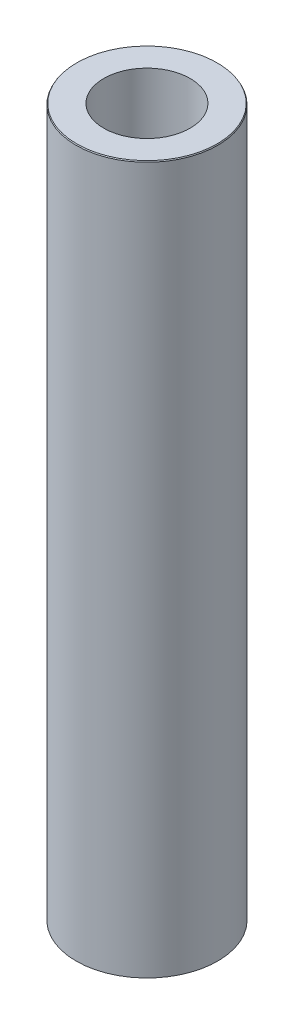
ISO-10303-21;
HEADER;
FILE_DESCRIPTION(('STEP AP214'),'2;1');
FILE_NAME('part.step','',(''),(''),'','','');
FILE_SCHEMA(('AUTOMOTIVE_DESIGN { 1 0 10303 214 1 1 1 1 }'));
ENDSEC;
DATA;
#1=APPLICATION_CONTEXT('core data for automotive mechanical design processes');
#2=APPLICATION_PROTOCOL_DEFINITION('international standard','automotive_design',2000,#1);
#3=PRODUCT_CONTEXT('',#1,'mechanical');
#4=PRODUCT('Part','Part','',(#3));
#5=PRODUCT_RELATED_PRODUCT_CATEGORY('part','',(#4));
#6=PRODUCT_DEFINITION_FORMATION('','',#4);
#7=PRODUCT_DEFINITION_CONTEXT('part definition',#1,'design');
#8=PRODUCT_DEFINITION('design','',#6,#7);
#9=PRODUCT_DEFINITION_SHAPE('','',#8);
#10=(LENGTH_UNIT() NAMED_UNIT(*) SI_UNIT(.MILLI.,.METRE.));
#11=(NAMED_UNIT(*) PLANE_ANGLE_UNIT() SI_UNIT($,.RADIAN.));
#12=(NAMED_UNIT(*) SI_UNIT($,.STERADIAN.) SOLID_ANGLE_UNIT());
#13=UNCERTAINTY_MEASURE_WITH_UNIT(LENGTH_MEASURE(1.E-05),#10,'distance_accuracy_value','');
#14=(GEOMETRIC_REPRESENTATION_CONTEXT(3) GLOBAL_UNCERTAINTY_ASSIGNED_CONTEXT((#13)) GLOBAL_UNIT_ASSIGNED_CONTEXT((#10,
#11,#12)) REPRESENTATION_CONTEXT('',''));
#15=CARTESIAN_POINT('',(0.,0.,0.));
#16=DIRECTION('',(0.,0.,1.));
#17=DIRECTION('',(1.,0.,0.));
#18=AXIS2_PLACEMENT_3D('',#15,#16,#17);
#19=CARTESIAN_POINT('',(0.,600.,0.));
#20=DIRECTION('',(0.,-1.,0.));
#21=DIRECTION('',(0.,0.,-1.));
#22=AXIS2_PLACEMENT_3D('',#19,#20,#21);
#23=CYLINDRICAL_SURFACE('',#22,60.);
#24=CARTESIAN_POINT('',(0.,599.138992929305,0.));
#25=DIRECTION('',(0.,1.,0.));
#26=DIRECTION('',(0.,0.,1.));
#27=AXIS2_PLACEMENT_3D('',#24,#25,#26);
#28=CIRCLE('',#27,60.);
#29=CARTESIAN_POINT('',(0.,599.138992929305,60.));
#30=VERTEX_POINT('',#29);
#31=EDGE_CURVE('E50',#30,#30,#28,.F.);
#32=ORIENTED_EDGE('',*,*,#31,.T.);
#33=EDGE_LOOP('',(#32));
#34=FACE_BOUND('',#33,.T.);
#35=CARTESIAN_POINT('',(0.,0.497102664039906,0.));
#36=DIRECTION('',(0.,1.,0.));
#37=DIRECTION('',(0.,0.,1.));
#38=AXIS2_PLACEMENT_3D('',#35,#36,#37);
#39=CIRCLE('',#38,60.);
#40=CARTESIAN_POINT('',(0.,0.497102664039906,60.));
#41=VERTEX_POINT('',#40);
#42=EDGE_CURVE('E51',#41,#41,#39,.T.);
#43=ORIENTED_EDGE('',*,*,#42,.T.);
#44=EDGE_LOOP('',(#43));
#45=FACE_BOUND('',#44,.T.);
#46=ADVANCED_FACE('F39',(#34,#45),#23,.T.);
#47=CARTESIAN_POINT('',(0.,600.,0.));
#48=DIRECTION('',(0.,1.,0.));
#49=DIRECTION('',(0.,0.,1.));
#50=AXIS2_PLACEMENT_3D('',#47,#48,#49);
#51=PLANE('',#50);
#52=CARTESIAN_POINT('',(0.,600.,0.));
#53=DIRECTION('',(0.,1.,0.));
#54=DIRECTION('',(0.,0.,1.));
#55=AXIS2_PLACEMENT_3D('',#52,#53,#54);
#56=CIRCLE('',#55,59.5028973359601);
#57=CARTESIAN_POINT('',(0.,600.,59.5028973359601));
#58=VERTEX_POINT('',#57);
#59=EDGE_CURVE('E54',#58,#58,#56,.T.);
#60=ORIENTED_EDGE('',*,*,#59,.T.);
#61=EDGE_LOOP('',(#60));
#62=FACE_BOUND('',#61,.T.);
#63=CARTESIAN_POINT('',(0.,600.,0.));
#64=DIRECTION('',(0.,1.,0.));
#65=DIRECTION('',(0.,0.,1.));
#66=AXIS2_PLACEMENT_3D('',#63,#64,#65);
#67=CIRCLE('',#66,36.5787264290364);
#68=CARTESIAN_POINT('',(0.,600.,36.5787264290364));
#69=VERTEX_POINT('',#68);
#70=EDGE_CURVE('E58',#69,#69,#67,.T.);
#71=ORIENTED_EDGE('',*,*,#70,.F.);
#72=EDGE_LOOP('',(#71));
#73=FACE_BOUND('',#72,.T.);
#74=ADVANCED_FACE('F69',(#62,#73),#51,.T.);
#75=CARTESIAN_POINT('',(0.,0.,0.));
#76=DIRECTION('',(0.,1.,0.));
#77=DIRECTION('',(0.,0.,1.));
#78=AXIS2_PLACEMENT_3D('',#75,#76,#77);
#79=PLANE('',#78);
#80=CARTESIAN_POINT('',(0.,0.,0.));
#81=DIRECTION('',(0.,1.,0.));
#82=DIRECTION('',(0.,0.,1.));
#83=AXIS2_PLACEMENT_3D('',#80,#81,#82);
#84=CIRCLE('',#83,59.1389929293051);
#85=CARTESIAN_POINT('',(0.,0.,59.1389929293051));
#86=VERTEX_POINT('',#85);
#87=EDGE_CURVE('E10',#86,#86,#84,.F.);
#88=ORIENTED_EDGE('',*,*,#87,.T.);
#89=EDGE_LOOP('',(#88));
#90=FACE_BOUND('',#89,.T.);
#91=CARTESIAN_POINT('',(0.,0.,0.));
#92=DIRECTION('',(0.,1.,0.));
#93=DIRECTION('',(0.,0.,1.));
#94=AXIS2_PLACEMENT_3D('',#91,#92,#93);
#95=CIRCLE('',#94,36.5787264290364);
#96=CARTESIAN_POINT('',(0.,0.,36.5787264290364));
#97=VERTEX_POINT('',#96);
#98=EDGE_CURVE('E63',#97,#97,#95,.T.);
#99=ORIENTED_EDGE('',*,*,#98,.T.);
#100=EDGE_LOOP('',(#99));
#101=FACE_BOUND('',#100,.T.);
#102=ADVANCED_FACE('F75',(#90,#101),#79,.F.);
#103=CARTESIAN_POINT('',(0.,600.,0.));
#104=DIRECTION('',(0.,-1.,0.));
#105=DIRECTION('',(0.,0.,-1.));
#106=AXIS2_PLACEMENT_3D('',#103,#104,#105);
#107=CYLINDRICAL_SURFACE('',#106,36.5787264290364);
#108=ORIENTED_EDGE('',*,*,#70,.T.);
#109=EDGE_LOOP('',(#108));
#110=FACE_BOUND('',#109,.T.);
#111=ORIENTED_EDGE('',*,*,#98,.F.);
#112=EDGE_LOOP('',(#111));
#113=FACE_BOUND('',#112,.T.);
#114=ADVANCED_FACE('F70',(#110,#113),#107,.F.);
#115=CARTESIAN_POINT('',(0.,600.,0.));
#116=DIRECTION('',(0.,-1.,0.));
#117=DIRECTION('',(0.,0.,-1.));
#118=AXIS2_PLACEMENT_3D('',#115,#116,#117);
#119=CONICAL_SURFACE('',#118,59.5028973359601,0.523598775598271);
#120=ORIENTED_EDGE('',*,*,#31,.F.);
#121=EDGE_LOOP('',(#120));
#122=FACE_BOUND('',#121,.T.);
#123=ORIENTED_EDGE('',*,*,#59,.F.);
#124=EDGE_LOOP('',(#123));
#125=FACE_BOUND('',#124,.T.);
#126=ADVANCED_FACE('F81',(#122,#125),#119,.T.);
#127=CARTESIAN_POINT('',(0.,0.497102664039906,0.));
#128=DIRECTION('',(0.,1.,0.));
#129=DIRECTION('',(0.,0.,1.));
#130=AXIS2_PLACEMENT_3D('',#127,#128,#129);
#131=CONICAL_SURFACE('',#130,60.,1.04719755119655);
#132=ORIENTED_EDGE('',*,*,#87,.F.);
#133=EDGE_LOOP('',(#132));
#134=FACE_BOUND('',#133,.T.);
#135=ORIENTED_EDGE('',*,*,#42,.F.);
#136=EDGE_LOOP('',(#135));
#137=FACE_BOUND('',#136,.T.);
#138=ADVANCED_FACE('F45',(#134,#137),#131,.T.);
#139=CLOSED_SHELL('',(#46,#74,#102,#114,#126,#138));
#140=MANIFOLD_SOLID_BREP('B2',#139);
#141=ADVANCED_BREP_SHAPE_REPRESENTATION('',(#18,#140),#14);
#142=SHAPE_DEFINITION_REPRESENTATION(#9,#141);
ENDSEC;
END-ISO-10303-21;
